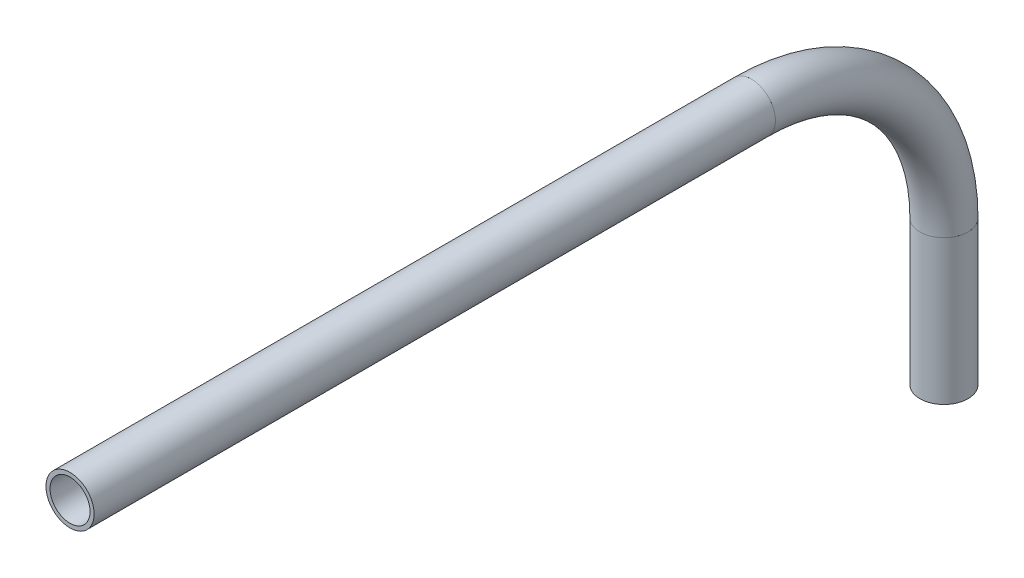
ISO-10303-21;
HEADER;
FILE_DESCRIPTION(('STEP AP214'),'2;1');
FILE_NAME('part.step','',(''),(''),'','','');
FILE_SCHEMA(('AUTOMOTIVE_DESIGN { 1 0 10303 214 1 1 1 1 }'));
ENDSEC;
DATA;
#1=APPLICATION_CONTEXT('core data for automotive mechanical design processes');
#2=APPLICATION_PROTOCOL_DEFINITION('international standard','automotive_design',2000,#1);
#3=PRODUCT_CONTEXT('',#1,'mechanical');
#4=PRODUCT('Part','Part','',(#3));
#5=PRODUCT_RELATED_PRODUCT_CATEGORY('part','',(#4));
#6=PRODUCT_DEFINITION_FORMATION('','',#4);
#7=PRODUCT_DEFINITION_CONTEXT('part definition',#1,'design');
#8=PRODUCT_DEFINITION('design','',#6,#7);
#9=PRODUCT_DEFINITION_SHAPE('','',#8);
#10=(LENGTH_UNIT() NAMED_UNIT(*) SI_UNIT(.MILLI.,.METRE.));
#11=(NAMED_UNIT(*) PLANE_ANGLE_UNIT() SI_UNIT($,.RADIAN.));
#12=(NAMED_UNIT(*) SI_UNIT($,.STERADIAN.) SOLID_ANGLE_UNIT());
#13=UNCERTAINTY_MEASURE_WITH_UNIT(LENGTH_MEASURE(1.E-05),#10,'distance_accuracy_value','');
#14=(GEOMETRIC_REPRESENTATION_CONTEXT(3) GLOBAL_UNCERTAINTY_ASSIGNED_CONTEXT((#13)) GLOBAL_UNIT_ASSIGNED_CONTEXT((#10,
#11,#12)) REPRESENTATION_CONTEXT('',''));
#15=CARTESIAN_POINT('',(0.,0.,0.));
#16=DIRECTION('',(0.,0.,1.));
#17=DIRECTION('',(1.,0.,0.));
#18=AXIS2_PLACEMENT_3D('',#15,#16,#17);
#19=CARTESIAN_POINT('',(0.,-232.817799036013,129.639190881221));
#20=DIRECTION('',(0.,0.,1.));
#21=DIRECTION('',(1.,0.,0.));
#22=AXIS2_PLACEMENT_3D('',#19,#20,#21);
#23=CYLINDRICAL_SURFACE('',#22,5.2832);
#24=CARTESIAN_POINT('',(0.,-232.817799036013,309.318661743265));
#25=DIRECTION('',(0.,0.,-1.));
#26=DIRECTION('',(0.,1.,0.));
#27=AXIS2_PLACEMENT_3D('',#24,#25,#26);
#28=CIRCLE('',#27,5.2832);
#29=CARTESIAN_POINT('',(5.2832,-232.817799036013,309.318661743265));
#30=VERTEX_POINT('',#29);
#31=EDGE_CURVE('E66',#30,#30,#28,.T.);
#32=CARTESIAN_POINT('',(0.,-232.817799036013,129.639190881221));
#33=DIRECTION('',(0.,0.,-1.));
#34=DIRECTION('',(0.,1.,0.));
#35=AXIS2_PLACEMENT_3D('',#32,#33,#34);
#36=CIRCLE('',#35,5.2832);
#37=CARTESIAN_POINT('',(5.2832,-232.817799036013,129.639190881221));
#38=VERTEX_POINT('',#37);
#39=EDGE_CURVE('E62',#38,#38,#36,.T.);
#40=CARTESIAN_POINT('',(5.2832,-232.817799036013,309.318661743265));
#41=CARTESIAN_POINT('',(5.2832,-232.817799036013,307.447000588452));
#42=CARTESIAN_POINT('',(5.2832,-232.817799036013,305.575339433639));
#43=CARTESIAN_POINT('',(5.2832,-232.817799036013,301.832017124013));
#44=CARTESIAN_POINT('',(5.2832,-232.817799036013,299.9603559692));
#45=CARTESIAN_POINT('',(5.2832,-232.817799036013,296.217033659574));
#46=CARTESIAN_POINT('',(5.2832,-232.817799036013,294.345372504761));
#47=CARTESIAN_POINT('',(5.2832,-232.817799036013,290.602050195135));
#48=CARTESIAN_POINT('',(5.2832,-232.817799036013,288.730389040322));
#49=CARTESIAN_POINT('',(5.2832,-232.817799036013,284.987066730696));
#50=CARTESIAN_POINT('',(5.2832,-232.817799036013,283.115405575883));
#51=CARTESIAN_POINT('',(5.2832,-232.817799036013,279.372083266257));
#52=CARTESIAN_POINT('',(5.2832,-232.817799036013,277.500422111444));
#53=CARTESIAN_POINT('',(5.2832,-232.817799036013,273.757099801819));
#54=CARTESIAN_POINT('',(5.2832,-232.817799036013,271.885438647006));
#55=CARTESIAN_POINT('',(5.2832,-232.817799036013,268.14211633738));
#56=CARTESIAN_POINT('',(5.2832,-232.817799036013,266.270455182567));
#57=CARTESIAN_POINT('',(5.2832,-232.817799036013,262.527132872941));
#58=CARTESIAN_POINT('',(5.2832,-232.817799036013,260.655471718128));
#59=CARTESIAN_POINT('',(5.2832,-232.817799036013,256.912149408502));
#60=CARTESIAN_POINT('',(5.2832,-232.817799036013,255.040488253689));
#61=CARTESIAN_POINT('',(5.2832,-232.817799036013,251.297165944063));
#62=CARTESIAN_POINT('',(5.2832,-232.817799036013,249.42550478925));
#63=CARTESIAN_POINT('',(5.2832,-232.817799036013,245.682182479624));
#64=CARTESIAN_POINT('',(5.2832,-232.817799036013,243.810521324811));
#65=CARTESIAN_POINT('',(5.2832,-232.817799036013,240.067199015185));
#66=CARTESIAN_POINT('',(5.2832,-232.817799036013,238.195537860372));
#67=CARTESIAN_POINT('',(5.2832,-232.817799036013,234.452215550747));
#68=CARTESIAN_POINT('',(5.2832,-232.817799036013,232.580554395934));
#69=CARTESIAN_POINT('',(5.2832,-232.817799036013,228.837232086308));
#70=CARTESIAN_POINT('',(5.2832,-232.817799036013,226.965570931495));
#71=CARTESIAN_POINT('',(5.2832,-232.817799036013,223.222248621869));
#72=CARTESIAN_POINT('',(5.2832,-232.817799036013,221.350587467056));
#73=CARTESIAN_POINT('',(5.2832,-232.817799036013,217.60726515743));
#74=CARTESIAN_POINT('',(5.2832,-232.817799036013,215.735604002617));
#75=CARTESIAN_POINT('',(5.2832,-232.817799036013,211.992281692991));
#76=CARTESIAN_POINT('',(5.2832,-232.817799036013,210.120620538178));
#77=CARTESIAN_POINT('',(5.2832,-232.817799036013,206.377298228552));
#78=CARTESIAN_POINT('',(5.2832,-232.817799036013,204.505637073739));
#79=CARTESIAN_POINT('',(5.2832,-232.817799036013,200.762314764113));
#80=CARTESIAN_POINT('',(5.2832,-232.817799036013,198.8906536093));
#81=CARTESIAN_POINT('',(5.2832,-232.817799036013,195.147331299674));
#82=CARTESIAN_POINT('',(5.2832,-232.817799036013,193.275670144862));
#83=CARTESIAN_POINT('',(5.2832,-232.817799036013,189.532347835236));
#84=CARTESIAN_POINT('',(5.2832,-232.817799036013,187.660686680423));
#85=CARTESIAN_POINT('',(5.2832,-232.817799036013,183.917364370797));
#86=CARTESIAN_POINT('',(5.2832,-232.817799036013,182.045703215984));
#87=CARTESIAN_POINT('',(5.2832,-232.817799036013,178.302380906358));
#88=CARTESIAN_POINT('',(5.2832,-232.817799036013,176.430719751545));
#89=CARTESIAN_POINT('',(5.2832,-232.817799036013,172.687397441919));
#90=CARTESIAN_POINT('',(5.2832,-232.817799036013,170.815736287106));
#91=CARTESIAN_POINT('',(5.2832,-232.817799036013,167.07241397748));
#92=CARTESIAN_POINT('',(5.2832,-232.817799036013,165.200752822667));
#93=CARTESIAN_POINT('',(5.2832,-232.817799036013,161.457430513041));
#94=CARTESIAN_POINT('',(5.2832,-232.817799036013,159.585769358228));
#95=CARTESIAN_POINT('',(5.2832,-232.817799036013,155.842447048602));
#96=CARTESIAN_POINT('',(5.2832,-232.817799036013,153.97078589379));
#97=CARTESIAN_POINT('',(5.2832,-232.817799036013,150.227463584164));
#98=CARTESIAN_POINT('',(5.2832,-232.817799036013,148.355802429351));
#99=CARTESIAN_POINT('',(5.2832,-232.817799036013,144.612480119725));
#100=CARTESIAN_POINT('',(5.2832,-232.817799036013,142.740818964912));
#101=CARTESIAN_POINT('',(5.2832,-232.817799036013,138.997496655286));
#102=CARTESIAN_POINT('',(5.2832,-232.817799036013,137.125835500473));
#103=CARTESIAN_POINT('',(5.2832,-232.817799036013,133.382513190847));
#104=CARTESIAN_POINT('',(5.2832,-232.817799036013,131.510852036034));
#105=CARTESIAN_POINT('',(5.2832,-232.817799036013,129.639190881221));
#106=B_SPLINE_CURVE_WITH_KNOTS('',3,(#40,#41,#42,#43,#44,#45,#46,#47,#48,#49,#50,#51,#52,#53,
#54,#55,#56,#57,#58,#59,#60,#61,#62,#63,#64,#65,#66,#67,#68,#69,#70,#71,#72,#73,#74,#75,#76,#77,
#78,#79,#80,#81,#82,#83,#84,#85,#86,#87,#88,#89,#90,#91,#92,#93,#94,#95,#96,#97,#98,#99,#100,
#101,#102,#103,#104,#105),.UNSPECIFIED.,.F.,.F.,(4,2,2,2,2,2,2,2,2,2,2,2,2,2,2,2,2,2,2,2,2,2,2,
2,2,2,2,2,2,2,2,2,4),(0.,5.61498346443884,11.2299669288777,16.8449503933166,22.4599338577554,
28.0749173221942,33.6899007866331,39.304884251072,44.9198677155108,50.5348511799497,
56.1498346443886,61.7648181088274,67.3798015732663,72.9947850377051,78.609768502144,
84.2247519665829,89.8397354310217,95.4547188954606,101.069702359899,106.684685824338,
112.299669288777,117.914652753216,123.529636217655,129.144619682094,134.759603146533,
140.374586610971,145.98957007541,151.604553539849,157.219537004288,162.834520468727,
168.449503933166,174.064487397605,179.679470862043),.UNSPECIFIED.);
#107=EDGE_CURVE('BSEAM58',#30,#38,#106,.T.);
#108=ORIENTED_EDGE('',*,*,#31,.F.);
#109=ORIENTED_EDGE('',*,*,#39,.T.);
#110=ORIENTED_EDGE('',*,*,#107,.T.);
#111=ORIENTED_EDGE('',*,*,#107,.F.);
#112=EDGE_LOOP('',(#108,#110,#109,#111));
#113=FACE_BOUND('',#112,.T.);
#114=ADVANCED_FACE('F58',(#113),#23,.F.);
#115=CARTESIAN_POINT('',(0.,-232.817799036013,129.639190881221));
#116=DIRECTION('',(0.,0.,1.));
#117=DIRECTION('',(1.,0.,0.));
#118=AXIS2_PLACEMENT_3D('',#115,#116,#117);
#119=CYLINDRICAL_SURFACE('',#118,6.35);
#120=CARTESIAN_POINT('',(0.,-232.817799036013,309.318661743265));
#121=DIRECTION('',(0.,0.,-1.));
#122=DIRECTION('',(0.,1.,0.));
#123=AXIS2_PLACEMENT_3D('',#120,#121,#122);
#124=CIRCLE('',#123,6.35);
#125=CARTESIAN_POINT('',(6.35,-232.817799036013,309.318661743265));
#126=VERTEX_POINT('',#125);
#127=EDGE_CURVE('E70',#126,#126,#124,.T.);
#128=CARTESIAN_POINT('',(0.,-232.817799036013,129.639190881221));
#129=DIRECTION('',(0.,0.,-1.));
#130=DIRECTION('',(0.,1.,0.));
#131=AXIS2_PLACEMENT_3D('',#128,#129,#130);
#132=CIRCLE('',#131,6.35);
#133=CARTESIAN_POINT('',(6.35,-232.817799036013,129.639190881221));
#134=VERTEX_POINT('',#133);
#135=EDGE_CURVE('E14',#134,#134,#132,.T.);
#136=CARTESIAN_POINT('',(6.35,-232.817799036013,309.318661743265));
#137=CARTESIAN_POINT('',(6.35,-232.817799036013,307.447000588452));
#138=CARTESIAN_POINT('',(6.35,-232.817799036013,305.575339433639));
#139=CARTESIAN_POINT('',(6.35,-232.817799036013,301.832017124013));
#140=CARTESIAN_POINT('',(6.35,-232.817799036013,299.9603559692));
#141=CARTESIAN_POINT('',(6.35,-232.817799036013,296.217033659574));
#142=CARTESIAN_POINT('',(6.35,-232.817799036013,294.345372504761));
#143=CARTESIAN_POINT('',(6.35,-232.817799036013,290.602050195135));
#144=CARTESIAN_POINT('',(6.35,-232.817799036013,288.730389040322));
#145=CARTESIAN_POINT('',(6.35,-232.817799036013,284.987066730696));
#146=CARTESIAN_POINT('',(6.35,-232.817799036013,283.115405575883));
#147=CARTESIAN_POINT('',(6.35,-232.817799036013,279.372083266257));
#148=CARTESIAN_POINT('',(6.35,-232.817799036013,277.500422111444));
#149=CARTESIAN_POINT('',(6.35,-232.817799036013,273.757099801819));
#150=CARTESIAN_POINT('',(6.35,-232.817799036013,271.885438647006));
#151=CARTESIAN_POINT('',(6.35,-232.817799036013,268.14211633738));
#152=CARTESIAN_POINT('',(6.35,-232.817799036013,266.270455182567));
#153=CARTESIAN_POINT('',(6.35,-232.817799036013,262.527132872941));
#154=CARTESIAN_POINT('',(6.35,-232.817799036013,260.655471718128));
#155=CARTESIAN_POINT('',(6.35,-232.817799036013,256.912149408502));
#156=CARTESIAN_POINT('',(6.35,-232.817799036013,255.040488253689));
#157=CARTESIAN_POINT('',(6.35,-232.817799036013,251.297165944063));
#158=CARTESIAN_POINT('',(6.35,-232.817799036013,249.42550478925));
#159=CARTESIAN_POINT('',(6.35,-232.817799036013,245.682182479624));
#160=CARTESIAN_POINT('',(6.35,-232.817799036013,243.810521324811));
#161=CARTESIAN_POINT('',(6.35,-232.817799036013,240.067199015185));
#162=CARTESIAN_POINT('',(6.35,-232.817799036013,238.195537860372));
#163=CARTESIAN_POINT('',(6.35,-232.817799036013,234.452215550747));
#164=CARTESIAN_POINT('',(6.35,-232.817799036013,232.580554395934));
#165=CARTESIAN_POINT('',(6.35,-232.817799036013,228.837232086308));
#166=CARTESIAN_POINT('',(6.35,-232.817799036013,226.965570931495));
#167=CARTESIAN_POINT('',(6.35,-232.817799036013,223.222248621869));
#168=CARTESIAN_POINT('',(6.35,-232.817799036013,221.350587467056));
#169=CARTESIAN_POINT('',(6.35,-232.817799036013,217.60726515743));
#170=CARTESIAN_POINT('',(6.35,-232.817799036013,215.735604002617));
#171=CARTESIAN_POINT('',(6.35,-232.817799036013,211.992281692991));
#172=CARTESIAN_POINT('',(6.35,-232.817799036013,210.120620538178));
#173=CARTESIAN_POINT('',(6.35,-232.817799036013,206.377298228552));
#174=CARTESIAN_POINT('',(6.35,-232.817799036013,204.505637073739));
#175=CARTESIAN_POINT('',(6.35,-232.817799036013,200.762314764113));
#176=CARTESIAN_POINT('',(6.35,-232.817799036013,198.8906536093));
#177=CARTESIAN_POINT('',(6.35,-232.817799036013,195.147331299674));
#178=CARTESIAN_POINT('',(6.35,-232.817799036013,193.275670144862));
#179=CARTESIAN_POINT('',(6.35,-232.817799036013,189.532347835236));
#180=CARTESIAN_POINT('',(6.35,-232.817799036013,187.660686680423));
#181=CARTESIAN_POINT('',(6.35,-232.817799036013,183.917364370797));
#182=CARTESIAN_POINT('',(6.35,-232.817799036013,182.045703215984));
#183=CARTESIAN_POINT('',(6.35,-232.817799036013,178.302380906358));
#184=CARTESIAN_POINT('',(6.35,-232.817799036013,176.430719751545));
#185=CARTESIAN_POINT('',(6.35,-232.817799036013,172.687397441919));
#186=CARTESIAN_POINT('',(6.35,-232.817799036013,170.815736287106));
#187=CARTESIAN_POINT('',(6.35,-232.817799036013,167.07241397748));
#188=CARTESIAN_POINT('',(6.35,-232.817799036013,165.200752822667));
#189=CARTESIAN_POINT('',(6.35,-232.817799036013,161.457430513041));
#190=CARTESIAN_POINT('',(6.35,-232.817799036013,159.585769358228));
#191=CARTESIAN_POINT('',(6.35,-232.817799036013,155.842447048602));
#192=CARTESIAN_POINT('',(6.35,-232.817799036013,153.97078589379));
#193=CARTESIAN_POINT('',(6.35,-232.817799036013,150.227463584164));
#194=CARTESIAN_POINT('',(6.35,-232.817799036013,148.355802429351));
#195=CARTESIAN_POINT('',(6.35,-232.817799036013,144.612480119725));
#196=CARTESIAN_POINT('',(6.35,-232.817799036013,142.740818964912));
#197=CARTESIAN_POINT('',(6.35,-232.817799036013,138.997496655286));
#198=CARTESIAN_POINT('',(6.35,-232.817799036013,137.125835500473));
#199=CARTESIAN_POINT('',(6.35,-232.817799036013,133.382513190847));
#200=CARTESIAN_POINT('',(6.35,-232.817799036013,131.510852036034));
#201=CARTESIAN_POINT('',(6.35,-232.817799036013,129.639190881221));
#202=B_SPLINE_CURVE_WITH_KNOTS('',3,(#136,#137,#138,#139,#140,#141,#142,#143,#144,#145,#146,
#147,#148,#149,#150,#151,#152,#153,#154,#155,#156,#157,#158,#159,#160,#161,#162,#163,#164,#165,
#166,#167,#168,#169,#170,#171,#172,#173,#174,#175,#176,#177,#178,#179,#180,#181,#182,#183,#184,
#185,#186,#187,#188,#189,#190,#191,#192,#193,#194,#195,#196,#197,#198,#199,#200,#201),
.UNSPECIFIED.,.F.,.F.,(4,2,2,2,2,2,2,2,2,2,2,2,2,2,2,2,2,2,2,2,2,2,2,2,2,2,2,2,2,2,2,2,4),(0.,
5.61498346443884,11.2299669288777,16.8449503933166,22.4599338577554,28.0749173221942,
33.6899007866331,39.304884251072,44.9198677155108,50.5348511799497,56.1498346443886,
61.7648181088274,67.3798015732663,72.9947850377051,78.609768502144,84.2247519665829,
89.8397354310217,95.4547188954606,101.069702359899,106.684685824338,112.299669288777,
117.914652753216,123.529636217655,129.144619682094,134.759603146533,140.374586610971,
145.98957007541,151.604553539849,157.219537004288,162.834520468727,168.449503933166,
174.064487397605,179.679470862043),.UNSPECIFIED.);
#203=EDGE_CURVE('BSEAM85',#126,#134,#202,.T.);
#204=ORIENTED_EDGE('',*,*,#127,.T.);
#205=ORIENTED_EDGE('',*,*,#135,.F.);
#206=ORIENTED_EDGE('',*,*,#203,.T.);
#207=ORIENTED_EDGE('',*,*,#203,.F.);
#208=EDGE_LOOP('',(#204,#206,#205,#207));
#209=FACE_BOUND('',#208,.T.);
#210=ADVANCED_FACE('F85',(#209),#119,.T.);
#211=CARTESIAN_POINT('',(0.,-232.817799036013,309.318661743265));
#212=DIRECTION('',(0.,0.,-1.));
#213=DIRECTION('',(0.,1.,0.));
#214=AXIS2_PLACEMENT_3D('',#211,#212,#213);
#215=PLANE('',#214);
#216=ORIENTED_EDGE('',*,*,#31,.T.);
#217=EDGE_LOOP('',(#216));
#218=FACE_BOUND('',#217,.T.);
#219=ORIENTED_EDGE('',*,*,#127,.F.);
#220=EDGE_LOOP('',(#219));
#221=FACE_BOUND('',#220,.T.);
#222=ADVANCED_FACE('F81',(#218,#221),#215,.F.);
#223=CARTESIAN_POINT('',(0.,-232.817799036013,129.639190881221));
#224=DIRECTION('',(0.,0.,-1.));
#225=DIRECTION('',(0.,1.,0.));
#226=AXIS2_PLACEMENT_3D('',#223,#224,#225);
#227=PLANE('',#226);
#228=ORIENTED_EDGE('',*,*,#39,.F.);
#229=EDGE_LOOP('',(#228));
#230=FACE_BOUND('',#229,.T.);
#231=ORIENTED_EDGE('',*,*,#135,.T.);
#232=EDGE_LOOP('',(#231));
#233=FACE_BOUND('',#232,.T.);
#234=ADVANCED_FACE('F60',(#230,#233),#227,.T.);
#235=CLOSED_SHELL('',(#114,#210,#222,#234));
#236=MANIFOLD_SOLID_BREP('B2',#235);
#237=CARTESIAN_POINT('',(0.,-283.617799036013,129.639190881221));
#238=DIRECTION('',(1.,0.,0.));
#239=DIRECTION('',(0.,0.,-1.));
#240=AXIS2_PLACEMENT_3D('',#237,#238,#239);
#241=TOROIDAL_SURFACE('',#240,50.8,5.2832);
#242=CARTESIAN_POINT('',(0.,-283.617799036013,78.8391908812211));
#243=DIRECTION('',(0.,-1.,0.));
#244=DIRECTION('',(0.,0.,-1.));
#245=AXIS2_PLACEMENT_3D('',#242,#243,#244);
#246=CIRCLE('',#245,5.2832);
#247=CARTESIAN_POINT('',(0.,-283.617799036013,73.5559908812211));
#248=VERTEX_POINT('',#247);
#249=EDGE_CURVE('E159',#248,#248,#246,.T.);
#250=CARTESIAN_POINT('',(0.,-232.817799036013,129.639190881221));
#251=DIRECTION('',(0.,0.,1.));
#252=DIRECTION('',(0.,-1.,0.));
#253=AXIS2_PLACEMENT_3D('',#250,#251,#252);
#254=CIRCLE('',#253,5.2832);
#255=CARTESIAN_POINT('',(0.,-227.534599036013,129.639190881221));
#256=VERTEX_POINT('',#255);
#257=EDGE_CURVE('E149',#256,#256,#254,.T.);
#258=CARTESIAN_POINT('',(0.,-283.617799036013,129.639190881221));
#259=DIRECTION('',(1.,0.,0.));
#260=DIRECTION('',(0.,0.,-1.));
#261=AXIS2_PLACEMENT_3D('',#258,#259,#260);
#262=CIRCLE('',#261,56.0832);
#263=EDGE_CURVE('',#248,#256,#262,.T.);
#264=ORIENTED_EDGE('',*,*,#249,.T.);
#265=ORIENTED_EDGE('',*,*,#257,.T.);
#266=ORIENTED_EDGE('',*,*,#263,.T.);
#267=ORIENTED_EDGE('',*,*,#263,.F.);
#268=EDGE_LOOP('',(#264,#266,#265,#267));
#269=FACE_BOUND('',#268,.T.);
#270=ADVANCED_FACE('F145',(#269),#241,.F.);
#271=CARTESIAN_POINT('',(0.,-283.617799036013,129.639190881221));
#272=DIRECTION('',(1.,0.,0.));
#273=DIRECTION('',(0.,0.,-1.));
#274=AXIS2_PLACEMENT_3D('',#271,#272,#273);
#275=TOROIDAL_SURFACE('',#274,50.8,6.35);
#276=CARTESIAN_POINT('',(0.,-283.617799036013,78.8391908812211));
#277=DIRECTION('',(0.,-1.,0.));
#278=DIRECTION('',(0.,0.,-1.));
#279=AXIS2_PLACEMENT_3D('',#276,#277,#278);
#280=CIRCLE('',#279,6.35);
#281=CARTESIAN_POINT('',(0.,-283.617799036013,72.4891908812211));
#282=VERTEX_POINT('',#281);
#283=EDGE_CURVE('E153',#282,#282,#280,.T.);
#284=CARTESIAN_POINT('',(0.,-232.817799036013,129.639190881221));
#285=DIRECTION('',(0.,0.,1.));
#286=DIRECTION('',(0.,-1.,0.));
#287=AXIS2_PLACEMENT_3D('',#284,#285,#286);
#288=CIRCLE('',#287,6.35);
#289=CARTESIAN_POINT('',(0.,-226.467799036013,129.639190881221));
#290=VERTEX_POINT('',#289);
#291=EDGE_CURVE('E57',#290,#290,#288,.T.);
#292=CARTESIAN_POINT('',(0.,-283.617799036013,129.639190881221));
#293=DIRECTION('',(1.,0.,0.));
#294=DIRECTION('',(0.,0.,-1.));
#295=AXIS2_PLACEMENT_3D('',#292,#293,#294);
#296=CIRCLE('',#295,57.15);
#297=EDGE_CURVE('',#282,#290,#296,.T.);
#298=ORIENTED_EDGE('',*,*,#283,.F.);
#299=ORIENTED_EDGE('',*,*,#291,.F.);
#300=ORIENTED_EDGE('',*,*,#297,.T.);
#301=ORIENTED_EDGE('',*,*,#297,.F.);
#302=EDGE_LOOP('',(#298,#300,#299,#301));
#303=FACE_BOUND('',#302,.T.);
#304=ADVANCED_FACE('F172',(#303),#275,.T.);
#305=CARTESIAN_POINT('',(0.,-283.617799036013,78.8391908812211));
#306=DIRECTION('',(0.,-1.,0.));
#307=DIRECTION('',(0.,0.,-1.));
#308=AXIS2_PLACEMENT_3D('',#305,#306,#307);
#309=PLANE('',#308);
#310=ORIENTED_EDGE('',*,*,#249,.F.);
#311=EDGE_LOOP('',(#310));
#312=FACE_BOUND('',#311,.T.);
#313=ORIENTED_EDGE('',*,*,#283,.T.);
#314=EDGE_LOOP('',(#313));
#315=FACE_BOUND('',#314,.T.);
#316=ADVANCED_FACE('F168',(#312,#315),#309,.T.);
#317=CARTESIAN_POINT('',(0.,-232.817799036013,129.639190881221));
#318=DIRECTION('',(0.,0.,1.));
#319=DIRECTION('',(0.,-1.,0.));
#320=AXIS2_PLACEMENT_3D('',#317,#318,#319);
#321=PLANE('',#320);
#322=ORIENTED_EDGE('',*,*,#257,.F.);
#323=EDGE_LOOP('',(#322));
#324=FACE_BOUND('',#323,.T.);
#325=ORIENTED_EDGE('',*,*,#291,.T.);
#326=EDGE_LOOP('',(#325));
#327=FACE_BOUND('',#326,.T.);
#328=ADVANCED_FACE('F147',(#324,#327),#321,.T.);
#329=CLOSED_SHELL('',(#270,#304,#316,#328));
#330=MANIFOLD_SOLID_BREP('B9',#329);
#331=CARTESIAN_POINT('',(0.,-321.717799036013,78.8391908812211));
#332=DIRECTION('',(0.,1.,0.));
#333=DIRECTION('',(0.,0.,1.));
#334=AXIS2_PLACEMENT_3D('',#331,#332,#333);
#335=CYLINDRICAL_SURFACE('',#334,5.2832);
#336=CARTESIAN_POINT('',(0.,-321.717799036013,78.8391908812211));
#337=DIRECTION('',(0.,-1.,0.));
#338=DIRECTION('',(0.,0.,-1.));
#339=AXIS2_PLACEMENT_3D('',#336,#337,#338);
#340=CIRCLE('',#339,5.2832);
#341=CARTESIAN_POINT('',(0.,-321.717799036013,73.5559908812211));
#342=VERTEX_POINT('',#341);
#343=EDGE_CURVE('E243',#342,#342,#340,.T.);
#344=ORIENTED_EDGE('',*,*,#343,.T.);
#345=EDGE_LOOP('',(#344));
#346=FACE_BOUND('',#345,.T.);
#347=CARTESIAN_POINT('',(0.,-283.617799036013,78.8391908812211));
#348=DIRECTION('',(0.,1.,0.));
#349=DIRECTION('',(0.,0.,1.));
#350=AXIS2_PLACEMENT_3D('',#347,#348,#349);
#351=CIRCLE('',#350,5.2832);
#352=CARTESIAN_POINT('',(0.,-283.617799036013,84.1223908812211));
#353=VERTEX_POINT('',#352);
#354=EDGE_CURVE('E233',#353,#353,#351,.T.);
#355=ORIENTED_EDGE('',*,*,#354,.T.);
#356=EDGE_LOOP('',(#355));
#357=FACE_BOUND('',#356,.T.);
#358=ADVANCED_FACE('F229',(#346,#357),#335,.F.);
#359=CARTESIAN_POINT('',(0.,-321.717799036013,78.8391908812211));
#360=DIRECTION('',(0.,1.,0.));
#361=DIRECTION('',(0.,0.,1.));
#362=AXIS2_PLACEMENT_3D('',#359,#360,#361);
#363=CYLINDRICAL_SURFACE('',#362,6.35);
#364=CARTESIAN_POINT('',(0.,-321.717799036013,78.8391908812211));
#365=DIRECTION('',(0.,-1.,0.));
#366=DIRECTION('',(0.,0.,-1.));
#367=AXIS2_PLACEMENT_3D('',#364,#365,#366);
#368=CIRCLE('',#367,6.35);
#369=CARTESIAN_POINT('',(0.,-321.717799036013,72.4891908812211));
#370=VERTEX_POINT('',#369);
#371=EDGE_CURVE('E237',#370,#370,#368,.T.);
#372=ORIENTED_EDGE('',*,*,#371,.F.);
#373=EDGE_LOOP('',(#372));
#374=FACE_BOUND('',#373,.T.);
#375=CARTESIAN_POINT('',(0.,-283.617799036013,78.8391908812211));
#376=DIRECTION('',(0.,1.,0.));
#377=DIRECTION('',(0.,0.,1.));
#378=AXIS2_PLACEMENT_3D('',#375,#376,#377);
#379=CIRCLE('',#378,6.35);
#380=CARTESIAN_POINT('',(0.,-283.617799036013,85.1891908812211));
#381=VERTEX_POINT('',#380);
#382=EDGE_CURVE('E144',#381,#381,#379,.T.);
#383=ORIENTED_EDGE('',*,*,#382,.F.);
#384=EDGE_LOOP('',(#383));
#385=FACE_BOUND('',#384,.T.);
#386=ADVANCED_FACE('F256',(#374,#385),#363,.T.);
#387=CARTESIAN_POINT('',(0.,-321.717799036013,78.8391908812211));
#388=DIRECTION('',(0.,-1.,0.));
#389=DIRECTION('',(0.,0.,-1.));
#390=AXIS2_PLACEMENT_3D('',#387,#388,#389);
#391=PLANE('',#390);
#392=ORIENTED_EDGE('',*,*,#343,.F.);
#393=EDGE_LOOP('',(#392));
#394=FACE_BOUND('',#393,.T.);
#395=ORIENTED_EDGE('',*,*,#371,.T.);
#396=EDGE_LOOP('',(#395));
#397=FACE_BOUND('',#396,.T.);
#398=ADVANCED_FACE('F252',(#394,#397),#391,.T.);
#399=CARTESIAN_POINT('',(0.,-283.617799036013,78.8391908812211));
#400=DIRECTION('',(0.,1.,0.));
#401=DIRECTION('',(0.,0.,1.));
#402=AXIS2_PLACEMENT_3D('',#399,#400,#401);
#403=PLANE('',#402);
#404=ORIENTED_EDGE('',*,*,#354,.F.);
#405=EDGE_LOOP('',(#404));
#406=FACE_BOUND('',#405,.T.);
#407=ORIENTED_EDGE('',*,*,#382,.T.);
#408=EDGE_LOOP('',(#407));
#409=FACE_BOUND('',#408,.T.);
#410=ADVANCED_FACE('F231',(#406,#409),#403,.T.);
#411=CLOSED_SHELL('',(#358,#386,#398,#410));
#412=MANIFOLD_SOLID_BREP('B52',#411);
#413=ADVANCED_BREP_SHAPE_REPRESENTATION('',(#18,#236,#330,#412),#14);
#414=SHAPE_DEFINITION_REPRESENTATION(#9,#413);
ENDSEC;
END-ISO-10303-21;
